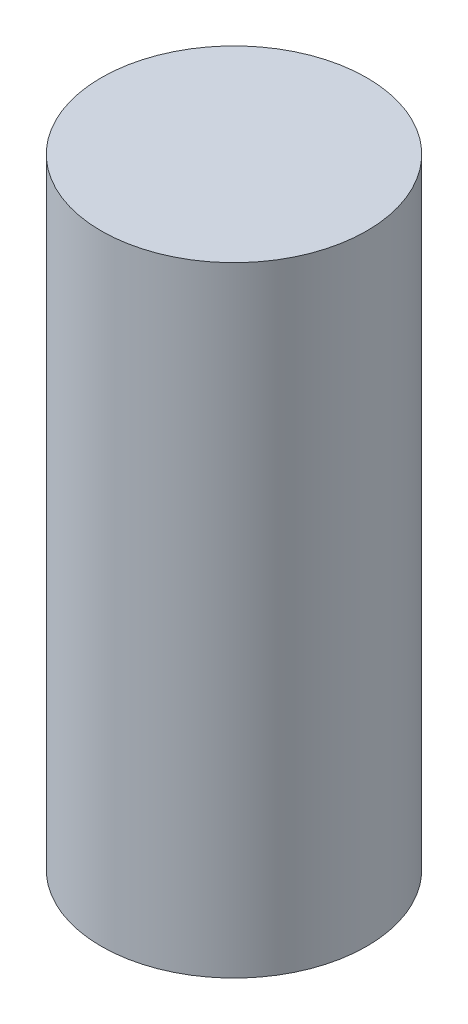
ISO-10303-21;
HEADER;
FILE_DESCRIPTION(('STEP AP214'),'2;1');
FILE_NAME('part.step','',(''),(''),'','','');
FILE_SCHEMA(('AUTOMOTIVE_DESIGN { 1 0 10303 214 1 1 1 1 }'));
ENDSEC;
DATA;
#1=APPLICATION_CONTEXT('core data for automotive mechanical design processes');
#2=APPLICATION_PROTOCOL_DEFINITION('international standard','automotive_design',2000,#1);
#3=PRODUCT_CONTEXT('',#1,'mechanical');
#4=PRODUCT('Part','Part','',(#3));
#5=PRODUCT_RELATED_PRODUCT_CATEGORY('part','',(#4));
#6=PRODUCT_DEFINITION_FORMATION('','',#4);
#7=PRODUCT_DEFINITION_CONTEXT('part definition',#1,'design');
#8=PRODUCT_DEFINITION('design','',#6,#7);
#9=PRODUCT_DEFINITION_SHAPE('','',#8);
#10=(LENGTH_UNIT() NAMED_UNIT(*) SI_UNIT(.MILLI.,.METRE.));
#11=(NAMED_UNIT(*) PLANE_ANGLE_UNIT() SI_UNIT($,.RADIAN.));
#12=(NAMED_UNIT(*) SI_UNIT($,.STERADIAN.) SOLID_ANGLE_UNIT());
#13=UNCERTAINTY_MEASURE_WITH_UNIT(LENGTH_MEASURE(1.E-05),#10,'distance_accuracy_value','');
#14=(GEOMETRIC_REPRESENTATION_CONTEXT(3) GLOBAL_UNCERTAINTY_ASSIGNED_CONTEXT((#13)) GLOBAL_UNIT_ASSIGNED_CONTEXT((#10,
#11,#12)) REPRESENTATION_CONTEXT('',''));
#15=CARTESIAN_POINT('',(0.,0.,0.));
#16=DIRECTION('',(0.,0.,1.));
#17=DIRECTION('',(1.,0.,0.));
#18=AXIS2_PLACEMENT_3D('',#15,#16,#17);
#19=CARTESIAN_POINT('',(0.,7.,0.));
#20=DIRECTION('',(0.,-1.,0.));
#21=DIRECTION('',(0.,0.,-1.));
#22=AXIS2_PLACEMENT_3D('',#19,#20,#21);
#23=CYLINDRICAL_SURFACE('',#22,1.5);
#24=CARTESIAN_POINT('',(0.,7.,0.));
#25=DIRECTION('',(0.,1.,0.));
#26=DIRECTION('',(0.,0.,1.));
#27=AXIS2_PLACEMENT_3D('',#24,#25,#26);
#28=CIRCLE('',#27,1.5);
#29=CARTESIAN_POINT('',(0.,7.,1.5));
#30=VERTEX_POINT('',#29);
#31=EDGE_CURVE('E10',#30,#30,#28,.T.);
#32=ORIENTED_EDGE('',*,*,#31,.F.);
#33=EDGE_LOOP('',(#32));
#34=FACE_BOUND('',#33,.T.);
#35=CARTESIAN_POINT('',(0.,0.,0.));
#36=DIRECTION('',(0.,1.,0.));
#37=DIRECTION('',(0.,0.,1.));
#38=AXIS2_PLACEMENT_3D('',#35,#36,#37);
#39=CIRCLE('',#38,1.5);
#40=CARTESIAN_POINT('',(0.,0.,1.5));
#41=VERTEX_POINT('',#40);
#42=EDGE_CURVE('E34',#41,#41,#39,.T.);
#43=ORIENTED_EDGE('',*,*,#42,.T.);
#44=EDGE_LOOP('',(#43));
#45=FACE_BOUND('',#44,.T.);
#46=ADVANCED_FACE('F31',(#34,#45),#23,.T.);
#47=CARTESIAN_POINT('',(0.,7.,0.));
#48=DIRECTION('',(0.,1.,0.));
#49=DIRECTION('',(0.,0.,1.));
#50=AXIS2_PLACEMENT_3D('',#47,#48,#49);
#51=PLANE('',#50);
#52=ORIENTED_EDGE('',*,*,#31,.T.);
#53=EDGE_LOOP('',(#52));
#54=FACE_BOUND('',#53,.T.);
#55=ADVANCED_FACE('F46',(#54),#51,.T.);
#56=CARTESIAN_POINT('',(0.,0.,0.));
#57=DIRECTION('',(0.,1.,0.));
#58=DIRECTION('',(0.,0.,1.));
#59=AXIS2_PLACEMENT_3D('',#56,#57,#58);
#60=PLANE('',#59);
#61=ORIENTED_EDGE('',*,*,#42,.F.);
#62=EDGE_LOOP('',(#61));
#63=FACE_BOUND('',#62,.T.);
#64=ADVANCED_FACE('F44',(#63),#60,.F.);
#65=CLOSED_SHELL('',(#46,#55,#64));
#66=MANIFOLD_SOLID_BREP('B2',#65);
#67=ADVANCED_BREP_SHAPE_REPRESENTATION('',(#18,#66),#14);
#68=SHAPE_DEFINITION_REPRESENTATION(#9,#67);
ENDSEC;
END-ISO-10303-21;
